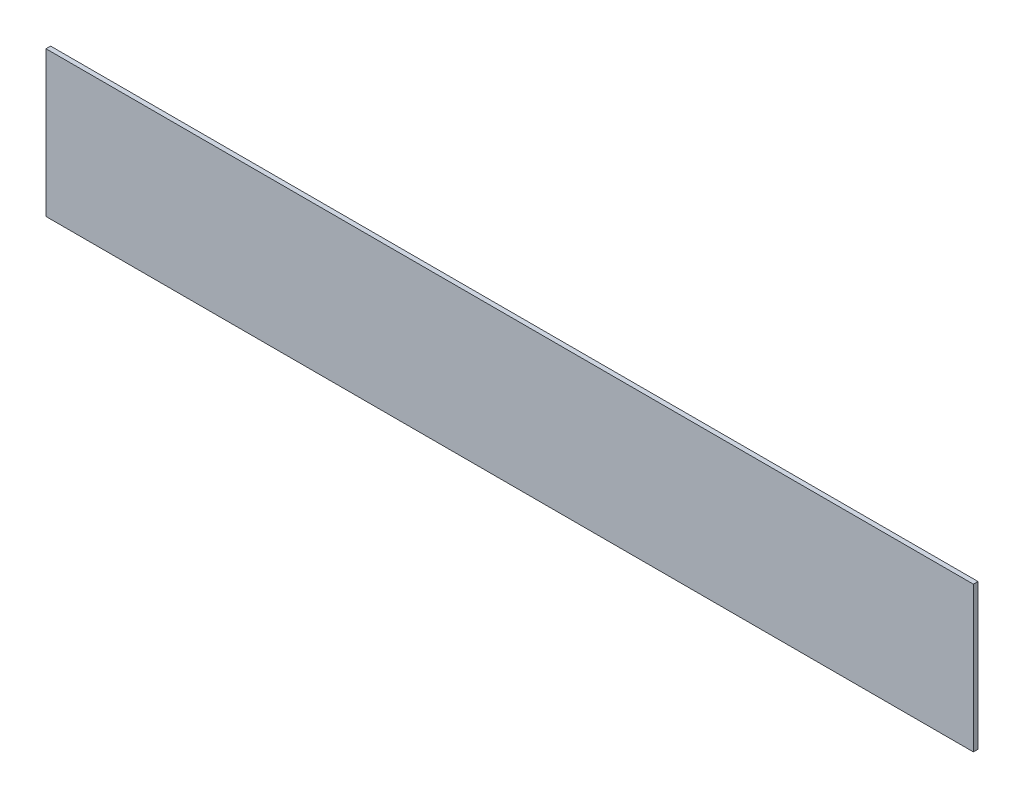
ISO-10303-21;
HEADER;
FILE_DESCRIPTION(('STEP AP214'),'2;1');
FILE_NAME('part.step','',(''),(''),'','','');
FILE_SCHEMA(('AUTOMOTIVE_DESIGN { 1 0 10303 214 1 1 1 1 }'));
ENDSEC;
DATA;
#1=APPLICATION_CONTEXT('core data for automotive mechanical design processes');
#2=APPLICATION_PROTOCOL_DEFINITION('international standard','automotive_design',2000,#1);
#3=PRODUCT_CONTEXT('',#1,'mechanical');
#4=PRODUCT('Part','Part','',(#3));
#5=PRODUCT_RELATED_PRODUCT_CATEGORY('part','',(#4));
#6=PRODUCT_DEFINITION_FORMATION('','',#4);
#7=PRODUCT_DEFINITION_CONTEXT('part definition',#1,'design');
#8=PRODUCT_DEFINITION('design','',#6,#7);
#9=PRODUCT_DEFINITION_SHAPE('','',#8);
#10=(LENGTH_UNIT() NAMED_UNIT(*) SI_UNIT(.MILLI.,.METRE.));
#11=(NAMED_UNIT(*) PLANE_ANGLE_UNIT() SI_UNIT($,.RADIAN.));
#12=(NAMED_UNIT(*) SI_UNIT($,.STERADIAN.) SOLID_ANGLE_UNIT());
#13=UNCERTAINTY_MEASURE_WITH_UNIT(LENGTH_MEASURE(1.E-05),#10,'distance_accuracy_value','');
#14=(GEOMETRIC_REPRESENTATION_CONTEXT(3) GLOBAL_UNCERTAINTY_ASSIGNED_CONTEXT((#13)) GLOBAL_UNIT_ASSIGNED_CONTEXT((#10,
#11,#12)) REPRESENTATION_CONTEXT('',''));
#15=CARTESIAN_POINT('',(0.,0.,0.));
#16=DIRECTION('',(0.,0.,1.));
#17=DIRECTION('',(1.,0.,0.));
#18=AXIS2_PLACEMENT_3D('',#15,#16,#17);
#19=CARTESIAN_POINT('',(300.,1.71683972880179E-13,0.));
#20=DIRECTION('',(-1.,0.,0.));
#21=DIRECTION('',(0.,-1.,0.));
#22=AXIS2_PLACEMENT_3D('',#19,#20,#21);
#23=PLANE('',#22);
#24=DIRECTION('',(0.,0.,-1.));
#25=VECTOR('',#24,1.);
#26=CARTESIAN_POINT('',(300.,47.,60.01));
#27=LINE('',#26,#25);
#28=CARTESIAN_POINT('',(300.,47.,3.));
#29=VERTEX_POINT('',#28);
#30=CARTESIAN_POINT('',(300.,47.,0.));
#31=VERTEX_POINT('',#30);
#32=EDGE_CURVE('E81',#29,#31,#27,.T.);
#33=ORIENTED_EDGE('',*,*,#32,.F.);
#34=DIRECTION('',(0.,-1.,0.));
#35=VECTOR('',#34,1.);
#36=CARTESIAN_POINT('',(300.,3.43367945760358E-13,3.));
#37=LINE('',#36,#35);
#38=CARTESIAN_POINT('',(300.,-47.,3.));
#39=VERTEX_POINT('',#38);
#40=EDGE_CURVE('E86',#29,#39,#37,.T.);
#41=ORIENTED_EDGE('',*,*,#40,.T.);
#42=DIRECTION('',(0.,0.,-1.));
#43=VECTOR('',#42,1.);
#44=CARTESIAN_POINT('',(300.,-47.,60.01));
#45=LINE('',#44,#43);
#46=CARTESIAN_POINT('',(300.,-47.,0.));
#47=VERTEX_POINT('',#46);
#48=EDGE_CURVE('E36',#39,#47,#45,.T.);
#49=ORIENTED_EDGE('',*,*,#48,.T.);
#50=DIRECTION('',(0.,-1.,0.));
#51=VECTOR('',#50,1.);
#52=CARTESIAN_POINT('',(300.,3.43367945760358E-13,0.));
#53=LINE('',#52,#51);
#54=EDGE_CURVE('E49',#31,#47,#53,.T.);
#55=ORIENTED_EDGE('',*,*,#54,.F.);
#56=EDGE_LOOP('',(#33,#41,#49,#55));
#57=FACE_BOUND('',#56,.T.);
#58=ADVANCED_FACE('F32',(#57),#23,.F.);
#59=CARTESIAN_POINT('',(-300.,0.,0.));
#60=DIRECTION('',(-1.,0.,0.));
#61=DIRECTION('',(0.,0.,1.));
#62=AXIS2_PLACEMENT_3D('',#59,#60,#61);
#63=PLANE('',#62);
#64=DIRECTION('',(0.,0.,-1.));
#65=VECTOR('',#64,1.);
#66=CARTESIAN_POINT('',(-300.,47.,60.01));
#67=LINE('',#66,#65);
#68=CARTESIAN_POINT('',(-300.,47.,3.));
#69=VERTEX_POINT('',#68);
#70=CARTESIAN_POINT('',(-300.,47.,0.));
#71=VERTEX_POINT('',#70);
#72=EDGE_CURVE('E80',#69,#71,#67,.T.);
#73=ORIENTED_EDGE('',*,*,#72,.T.);
#74=DIRECTION('',(0.,-1.,0.));
#75=VECTOR('',#74,1.);
#76=CARTESIAN_POINT('',(-300.,0.,0.));
#77=LINE('',#76,#75);
#78=CARTESIAN_POINT('',(-300.,-47.,0.));
#79=VERTEX_POINT('',#78);
#80=EDGE_CURVE('E84',#71,#79,#77,.T.);
#81=ORIENTED_EDGE('',*,*,#80,.T.);
#82=DIRECTION('',(0.,0.,-1.));
#83=VECTOR('',#82,1.);
#84=CARTESIAN_POINT('',(-300.,-47.,60.01));
#85=LINE('',#84,#83);
#86=CARTESIAN_POINT('',(-300.,-47.,3.));
#87=VERTEX_POINT('',#86);
#88=EDGE_CURVE('E57',#87,#79,#85,.T.);
#89=ORIENTED_EDGE('',*,*,#88,.F.);
#90=DIRECTION('',(0.,-1.,0.));
#91=VECTOR('',#90,1.);
#92=CARTESIAN_POINT('',(-300.,0.,3.));
#93=LINE('',#92,#91);
#94=EDGE_CURVE('E91',#69,#87,#93,.T.);
#95=ORIENTED_EDGE('',*,*,#94,.F.);
#96=EDGE_LOOP('',(#73,#81,#89,#95));
#97=FACE_BOUND('',#96,.T.);
#98=ADVANCED_FACE('F89',(#97),#63,.T.);
#99=CARTESIAN_POINT('',(300.,-47.,60.01));
#100=DIRECTION('',(0.,-1.,0.));
#101=DIRECTION('',(0.,0.,-1.));
#102=AXIS2_PLACEMENT_3D('',#99,#100,#101);
#103=PLANE('',#102);
#104=DIRECTION('',(1.,0.,0.));
#105=VECTOR('',#104,1.);
#106=CARTESIAN_POINT('',(-300.,-47.,3.));
#107=LINE('',#106,#105);
#108=EDGE_CURVE('E97',#87,#39,#107,.T.);
#109=ORIENTED_EDGE('',*,*,#108,.F.);
#110=ORIENTED_EDGE('',*,*,#88,.T.);
#111=DIRECTION('',(-1.,0.,0.));
#112=VECTOR('',#111,1.);
#113=CARTESIAN_POINT('',(300.,-47.,0.));
#114=LINE('',#113,#112);
#115=EDGE_CURVE('E41',#47,#79,#114,.T.);
#116=ORIENTED_EDGE('',*,*,#115,.F.);
#117=ORIENTED_EDGE('',*,*,#48,.F.);
#118=EDGE_LOOP('',(#109,#110,#116,#117));
#119=FACE_BOUND('',#118,.T.);
#120=ADVANCED_FACE('F106',(#119),#103,.T.);
#121=CARTESIAN_POINT('',(-300.,47.,60.01));
#122=DIRECTION('',(0.,1.,0.));
#123=DIRECTION('',(0.,0.,1.));
#124=AXIS2_PLACEMENT_3D('',#121,#122,#123);
#125=PLANE('',#124);
#126=DIRECTION('',(-1.,0.,0.));
#127=VECTOR('',#126,1.);
#128=CARTESIAN_POINT('',(300.,47.,3.));
#129=LINE('',#128,#127);
#130=EDGE_CURVE('E99',#29,#69,#129,.T.);
#131=ORIENTED_EDGE('',*,*,#130,.F.);
#132=ORIENTED_EDGE('',*,*,#32,.T.);
#133=DIRECTION('',(1.,0.,0.));
#134=VECTOR('',#133,1.);
#135=CARTESIAN_POINT('',(-300.,47.,0.));
#136=LINE('',#135,#134);
#137=EDGE_CURVE('E11',#71,#31,#136,.T.);
#138=ORIENTED_EDGE('',*,*,#137,.F.);
#139=ORIENTED_EDGE('',*,*,#72,.F.);
#140=EDGE_LOOP('',(#131,#132,#138,#139));
#141=FACE_BOUND('',#140,.T.);
#142=ADVANCED_FACE('F78',(#141),#125,.T.);
#143=CARTESIAN_POINT('',(-300.,0.,3.));
#144=DIRECTION('',(0.,0.,1.));
#145=DIRECTION('',(1.,0.,0.));
#146=AXIS2_PLACEMENT_3D('',#143,#144,#145);
#147=PLANE('',#146);
#148=ORIENTED_EDGE('',*,*,#40,.F.);
#149=ORIENTED_EDGE('',*,*,#130,.T.);
#150=ORIENTED_EDGE('',*,*,#94,.T.);
#151=ORIENTED_EDGE('',*,*,#108,.T.);
#152=EDGE_LOOP('',(#148,#149,#150,#151));
#153=FACE_BOUND('',#152,.T.);
#154=ADVANCED_FACE('F98',(#153),#147,.T.);
#155=CARTESIAN_POINT('',(-300.,0.,0.));
#156=DIRECTION('',(0.,0.,1.));
#157=DIRECTION('',(1.,0.,0.));
#158=AXIS2_PLACEMENT_3D('',#155,#156,#157);
#159=PLANE('',#158);
#160=ORIENTED_EDGE('',*,*,#137,.T.);
#161=ORIENTED_EDGE('',*,*,#54,.T.);
#162=ORIENTED_EDGE('',*,*,#115,.T.);
#163=ORIENTED_EDGE('',*,*,#80,.F.);
#164=EDGE_LOOP('',(#160,#161,#162,#163));
#165=FACE_BOUND('',#164,.T.);
#166=ADVANCED_FACE('F34',(#165),#159,.F.);
#167=CLOSED_SHELL('',(#58,#98,#120,#142,#154,#166));
#168=MANIFOLD_SOLID_BREP('B2',#167);
#169=ADVANCED_BREP_SHAPE_REPRESENTATION('',(#18,#168),#14);
#170=SHAPE_DEFINITION_REPRESENTATION(#9,#169);
ENDSEC;
END-ISO-10303-21;
